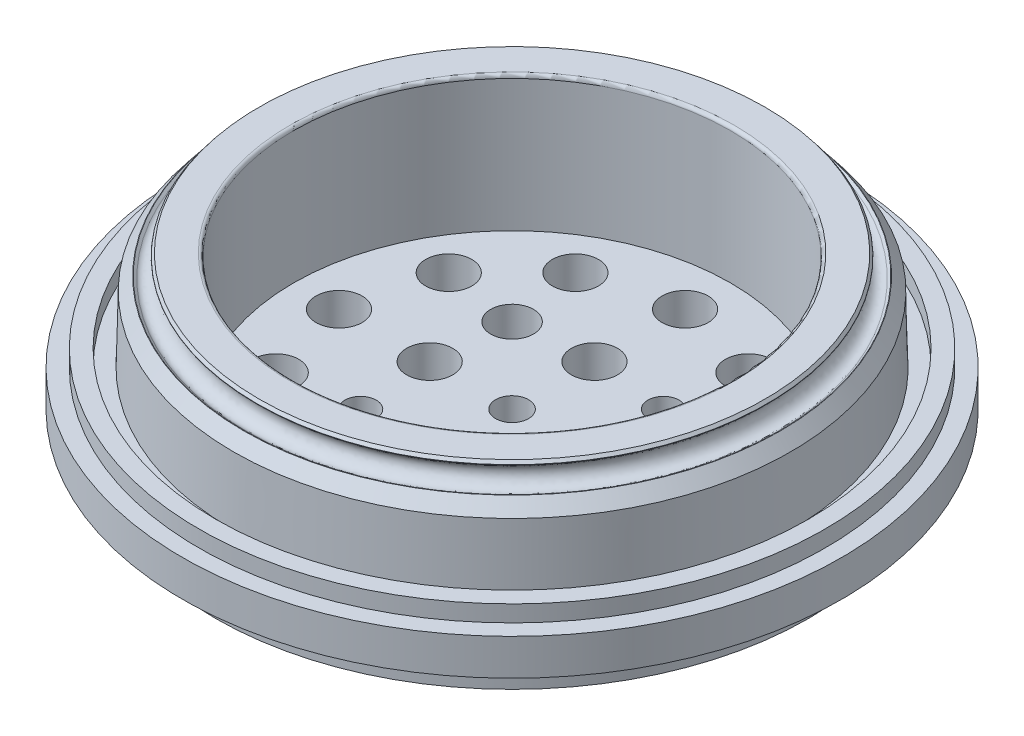
ISO-10303-21;
HEADER;
FILE_DESCRIPTION(('STEP AP214'),'2;1');
FILE_NAME('part.step','',(''),(''),'','','');
FILE_SCHEMA(('AUTOMOTIVE_DESIGN { 1 0 10303 214 1 1 1 1 }'));
ENDSEC;
DATA;
#1=APPLICATION_CONTEXT('core data for automotive mechanical design processes');
#2=APPLICATION_PROTOCOL_DEFINITION('international standard','automotive_design',2000,#1);
#3=PRODUCT_CONTEXT('',#1,'mechanical');
#4=PRODUCT('Part','Part','',(#3));
#5=PRODUCT_RELATED_PRODUCT_CATEGORY('part','',(#4));
#6=PRODUCT_DEFINITION_FORMATION('','',#4);
#7=PRODUCT_DEFINITION_CONTEXT('part definition',#1,'design');
#8=PRODUCT_DEFINITION('design','',#6,#7);
#9=PRODUCT_DEFINITION_SHAPE('','',#8);
#10=(LENGTH_UNIT() NAMED_UNIT(*) SI_UNIT(.MILLI.,.METRE.));
#11=(NAMED_UNIT(*) PLANE_ANGLE_UNIT() SI_UNIT($,.RADIAN.));
#12=(NAMED_UNIT(*) SI_UNIT($,.STERADIAN.) SOLID_ANGLE_UNIT());
#13=UNCERTAINTY_MEASURE_WITH_UNIT(LENGTH_MEASURE(1.E-05),#10,'distance_accuracy_value','');
#14=(GEOMETRIC_REPRESENTATION_CONTEXT(3) GLOBAL_UNCERTAINTY_ASSIGNED_CONTEXT((#13)) GLOBAL_UNIT_ASSIGNED_CONTEXT((#10,
#11,#12)) REPRESENTATION_CONTEXT('',''));
#15=CARTESIAN_POINT('',(0.,0.,0.));
#16=DIRECTION('',(0.,0.,1.));
#17=DIRECTION('',(1.,0.,0.));
#18=AXIS2_PLACEMENT_3D('',#15,#16,#17);
#19=CARTESIAN_POINT('',(78.5764516158101,36.6517230972502,0.));
#20=DIRECTION('',(0.,0.,1.));
#21=DIRECTION('',(-0.612631200186802,0.790368909154249,0.));
#22=AXIS2_PLACEMENT_3D('',#19,#20,#21);
#23=ELLIPSE('',#22,3.17500000000001,2.67499999999999);
#24=CARTESIAN_POINT('',(0.,0.,0.));
#25=DIRECTION('',(0.,-1.,0.));
#26=AXIS1_PLACEMENT('',#24,#25);
#27=SURFACE_OF_REVOLUTION('',#23,#26);
#28=CARTESIAN_POINT('',(0.,34.1423018106855,0.));
#29=DIRECTION('',(0.,-1.,0.));
#30=DIRECTION('',(0.,0.,-1.));
#31=AXIS2_PLACEMENT_3D('',#28,#29,#30);
#32=CIRCLE('',#31,80.5215556764032);
#33=CARTESIAN_POINT('',(0.,34.1423018106855,-80.5215556764032));
#34=VERTEX_POINT('',#33);
#35=EDGE_CURVE('E91',#34,#34,#32,.T.);
#36=ORIENTED_EDGE('',*,*,#35,.F.);
#37=EDGE_LOOP('',(#36));
#38=FACE_BOUND('',#37,.T.);
#39=CARTESIAN_POINT('',(0.,39.1611443838149,0.));
#40=DIRECTION('',(0.,-1.,0.));
#41=DIRECTION('',(0.,0.,-1.));
#42=AXIS2_PLACEMENT_3D('',#39,#40,#41);
#43=CIRCLE('',#42,76.631347555217);
#44=CARTESIAN_POINT('',(0.,39.1611443838149,-76.631347555217));
#45=VERTEX_POINT('',#44);
#46=EDGE_CURVE('E78',#45,#45,#43,.T.);
#47=ORIENTED_EDGE('',*,*,#46,.T.);
#48=EDGE_LOOP('',(#47));
#49=FACE_BOUND('',#48,.T.);
#50=ADVANCED_FACE('F43',(#38,#49),#27,.T.);
#51=CARTESIAN_POINT('',(0.,39.1611443838149,0.));
#52=DIRECTION('',(0.,1.,0.));
#53=DIRECTION('',(0.,0.,1.));
#54=AXIS2_PLACEMENT_3D('',#51,#52,#53);
#55=CONICAL_SURFACE('',#54,76.631347555217,0.911410935391439);
#56=CARTESIAN_POINT('',(0.,39.7529461231954,0.));
#57=DIRECTION('',(0.,1.,0.));
#58=DIRECTION('',(0.,0.,1.));
#59=AXIS2_PLACEMENT_3D('',#56,#57,#58);
#60=CIRCLE('',#59,77.39484392146);
#61=CARTESIAN_POINT('',(0.,39.7529461231954,77.39484392146));
#62=VERTEX_POINT('',#61);
#63=EDGE_CURVE('E63',#62,#62,#60,.F.);
#64=ORIENTED_EDGE('',*,*,#63,.T.);
#65=EDGE_LOOP('',(#64));
#66=FACE_BOUND('',#65,.T.);
#67=ORIENTED_EDGE('',*,*,#46,.F.);
#68=EDGE_LOOP('',(#67));
#69=FACE_BOUND('',#68,.T.);
#70=ADVANCED_FACE('F134',(#66,#69),#55,.T.);
#71=CARTESIAN_POINT('',(0.,40.74810371,0.));
#72=DIRECTION('',(0.,-1.,0.));
#73=DIRECTION('',(0.,0.,-1.));
#74=AXIS2_PLACEMENT_3D('',#71,#72,#73);
#75=CONICAL_SURFACE('',#74,76.75,0.65938539140346);
#76=CARTESIAN_POINT('',(0.,39.8932461341295,0.));
#77=DIRECTION('',(0.,-1.,0.));
#78=DIRECTION('',(0.,0.,-1.));
#79=AXIS2_PLACEMENT_3D('',#76,#77,#78);
#80=CIRCLE('',#79,77.4126176923568);
#81=CARTESIAN_POINT('',(0.,39.8932461341295,-77.4126176923568));
#82=VERTEX_POINT('',#81);
#83=EDGE_CURVE('E57',#82,#82,#80,.F.);
#84=ORIENTED_EDGE('',*,*,#83,.T.);
#85=EDGE_LOOP('',(#84));
#86=FACE_BOUND('',#85,.T.);
#87=CARTESIAN_POINT('',(0.,40.74810371,0.));
#88=DIRECTION('',(0.,-1.,0.));
#89=DIRECTION('',(0.,0.,-1.));
#90=AXIS2_PLACEMENT_3D('',#87,#88,#89);
#91=CIRCLE('',#90,76.75);
#92=CARTESIAN_POINT('',(0.,40.74810371,-76.75));
#93=VERTEX_POINT('',#92);
#94=EDGE_CURVE('E82',#93,#93,#91,.T.);
#95=ORIENTED_EDGE('',*,*,#94,.T.);
#96=EDGE_LOOP('',(#95));
#97=FACE_BOUND('',#96,.T.);
#98=ADVANCED_FACE('F161',(#86,#97),#75,.T.);
#99=CARTESIAN_POINT('',(0.,40.74810371,0.));
#100=DIRECTION('',(0.,-1.,0.));
#101=DIRECTION('',(0.,0.,-1.));
#102=AXIS2_PLACEMENT_3D('',#99,#100,#101);
#103=PLANE('',#102);
#104=CARTESIAN_POINT('',(0.,40.74810371,0.));
#105=DIRECTION('',(0.,-1.,0.));
#106=DIRECTION('',(0.,0.,-1.));
#107=AXIS2_PLACEMENT_3D('',#104,#105,#106);
#108=CIRCLE('',#107,67.3264516158101);
#109=CARTESIAN_POINT('',(0.,40.74810371,-67.3264516158101));
#110=VERTEX_POINT('',#109);
#111=EDGE_CURVE('E74',#110,#110,#108,.T.);
#112=ORIENTED_EDGE('',*,*,#111,.T.);
#113=EDGE_LOOP('',(#112));
#114=FACE_BOUND('',#113,.T.);
#115=ORIENTED_EDGE('',*,*,#94,.F.);
#116=EDGE_LOOP('',(#115));
#117=FACE_BOUND('',#116,.T.);
#118=ADVANCED_FACE('F167',(#114,#117),#103,.F.);
#119=CARTESIAN_POINT('',(0.,0.,0.));
#120=DIRECTION('',(0.,-1.,0.));
#121=DIRECTION('',(0.,0.,-1.));
#122=AXIS2_PLACEMENT_3D('',#119,#120,#121);
#123=CYLINDRICAL_SURFACE('',#122,66.3264516158101);
#124=CARTESIAN_POINT('',(0.,39.74810371,0.));
#125=DIRECTION('',(0.,-1.,0.));
#126=DIRECTION('',(0.,0.,-1.));
#127=AXIS2_PLACEMENT_3D('',#124,#125,#126);
#128=CIRCLE('',#127,66.3264516158101);
#129=CARTESIAN_POINT('',(0.,39.74810371,-66.3264516158101));
#130=VERTEX_POINT('',#129);
#131=EDGE_CURVE('E70',#130,#130,#128,.F.);
#132=ORIENTED_EDGE('',*,*,#131,.T.);
#133=EDGE_LOOP('',(#132));
#134=FACE_BOUND('',#133,.T.);
#135=CARTESIAN_POINT('',(0.,-0.262378674365377,0.));
#136=DIRECTION('',(0.,-1.,0.));
#137=DIRECTION('',(0.,0.,-1.));
#138=AXIS2_PLACEMENT_3D('',#135,#136,#137);
#139=CIRCLE('',#138,66.3264516158101);
#140=CARTESIAN_POINT('',(0.,-0.262378674365377,-66.3264516158101));
#141=VERTEX_POINT('',#140);
#142=EDGE_CURVE('E87',#141,#141,#139,.T.);
#143=ORIENTED_EDGE('',*,*,#142,.T.);
#144=EDGE_LOOP('',(#143));
#145=FACE_BOUND('',#144,.T.);
#146=ADVANCED_FACE('F173',(#134,#145),#123,.F.);
#147=CARTESIAN_POINT('',(0.,-0.262378674365377,0.));
#148=DIRECTION('',(0.,-1.,0.));
#149=DIRECTION('',(0.,0.,-1.));
#150=AXIS2_PLACEMENT_3D('',#147,#148,#149);
#151=PLANE('',#150);
#152=CARTESIAN_POINT('',(0.,-0.262378674365377,0.));
#153=DIRECTION('',(0.,-1.,0.));
#154=DIRECTION('',(0.,0.,-1.));
#155=AXIS2_PLACEMENT_3D('',#152,#153,#154);
#156=CIRCLE('',#155,90.);
#157=CARTESIAN_POINT('',(0.,-0.262378674365377,-90.));
#158=VERTEX_POINT('',#157);
#159=EDGE_CURVE('E69',#158,#158,#156,.T.);
#160=ORIENTED_EDGE('',*,*,#159,.F.);
#161=EDGE_LOOP('',(#160));
#162=FACE_BOUND('',#161,.T.);
#163=CARTESIAN_POINT('',(0.,-0.262378674365377,0.));
#164=DIRECTION('',(0.,-1.,0.));
#165=DIRECTION('',(0.,0.,-1.));
#166=AXIS2_PLACEMENT_3D('',#163,#164,#165);
#167=CIRCLE('',#166,100.);
#168=CARTESIAN_POINT('',(0.,-0.262378674365377,-100.));
#169=VERTEX_POINT('',#168);
#170=EDGE_CURVE('E86',#169,#169,#167,.T.);
#171=ORIENTED_EDGE('',*,*,#170,.T.);
#172=EDGE_LOOP('',(#171));
#173=FACE_BOUND('',#172,.T.);
#174=ADVANCED_FACE('F180',(#162,#173),#151,.T.);
#175=CARTESIAN_POINT('',(0.,0.,0.));
#176=DIRECTION('',(0.,-1.,0.));
#177=DIRECTION('',(0.,0.,-1.));
#178=AXIS2_PLACEMENT_3D('',#175,#176,#177);
#179=CYLINDRICAL_SURFACE('',#178,100.);
#180=ORIENTED_EDGE('',*,*,#170,.F.);
#181=EDGE_LOOP('',(#180));
#182=FACE_BOUND('',#181,.T.);
#183=CARTESIAN_POINT('',(0.,10.7376213256346,0.));
#184=DIRECTION('',(0.,-1.,0.));
#185=DIRECTION('',(0.,0.,-1.));
#186=AXIS2_PLACEMENT_3D('',#183,#184,#185);
#187=CIRCLE('',#186,100.);
#188=CARTESIAN_POINT('',(0.,10.7376213256346,-100.));
#189=VERTEX_POINT('',#188);
#190=EDGE_CURVE('E96',#189,#189,#187,.T.);
#191=ORIENTED_EDGE('',*,*,#190,.T.);
#192=EDGE_LOOP('',(#191));
#193=FACE_BOUND('',#192,.T.);
#194=ADVANCED_FACE('F184',(#182,#193),#179,.T.);
#195=CARTESIAN_POINT('',(0.,10.7376213256346,0.));
#196=DIRECTION('',(0.,-1.,0.));
#197=DIRECTION('',(0.,0.,-1.));
#198=AXIS2_PLACEMENT_3D('',#195,#196,#197);
#199=PLANE('',#198);
#200=ORIENTED_EDGE('',*,*,#190,.F.);
#201=EDGE_LOOP('',(#200));
#202=FACE_BOUND('',#201,.T.);
#203=CARTESIAN_POINT('',(0.,10.7376213256346,0.));
#204=DIRECTION('',(0.,-1.,0.));
#205=DIRECTION('',(0.,0.,-1.));
#206=AXIS2_PLACEMENT_3D('',#203,#204,#205);
#207=CIRCLE('',#206,95.);
#208=CARTESIAN_POINT('',(0.,10.7376213256346,-95.));
#209=VERTEX_POINT('',#208);
#210=EDGE_CURVE('E100',#209,#209,#207,.T.);
#211=ORIENTED_EDGE('',*,*,#210,.T.);
#212=EDGE_LOOP('',(#211));
#213=FACE_BOUND('',#212,.T.);
#214=ADVANCED_FACE('F188',(#202,#213),#199,.F.);
#215=CARTESIAN_POINT('',(0.,0.,0.));
#216=DIRECTION('',(0.,-1.,0.));
#217=DIRECTION('',(0.,0.,-1.));
#218=AXIS2_PLACEMENT_3D('',#215,#216,#217);
#219=CYLINDRICAL_SURFACE('',#218,95.);
#220=ORIENTED_EDGE('',*,*,#210,.F.);
#221=EDGE_LOOP('',(#220));
#222=FACE_BOUND('',#221,.T.);
#223=CARTESIAN_POINT('',(0.,15.7376213256346,0.));
#224=DIRECTION('',(0.,-1.,0.));
#225=DIRECTION('',(0.,0.,-1.));
#226=AXIS2_PLACEMENT_3D('',#223,#224,#225);
#227=CIRCLE('',#226,95.);
#228=CARTESIAN_POINT('',(0.,15.7376213256346,-95.));
#229=VERTEX_POINT('',#228);
#230=EDGE_CURVE('E104',#229,#229,#227,.T.);
#231=ORIENTED_EDGE('',*,*,#230,.T.);
#232=EDGE_LOOP('',(#231));
#233=FACE_BOUND('',#232,.T.);
#234=ADVANCED_FACE('F192',(#222,#233),#219,.T.);
#235=CARTESIAN_POINT('',(0.,15.7376213256346,0.));
#236=DIRECTION('',(0.,-1.,0.));
#237=DIRECTION('',(0.,0.,-1.));
#238=AXIS2_PLACEMENT_3D('',#235,#236,#237);
#239=PLANE('',#238);
#240=ORIENTED_EDGE('',*,*,#230,.F.);
#241=EDGE_LOOP('',(#240));
#242=FACE_BOUND('',#241,.T.);
#243=CARTESIAN_POINT('',(0.,15.7376213256346,0.));
#244=DIRECTION('',(0.,-1.,0.));
#245=DIRECTION('',(0.,0.,-1.));
#246=AXIS2_PLACEMENT_3D('',#243,#244,#245);
#247=CIRCLE('',#246,89.9);
#248=CARTESIAN_POINT('',(0.,15.7376213256346,-89.9));
#249=VERTEX_POINT('',#248);
#250=EDGE_CURVE('E108',#249,#249,#247,.T.);
#251=ORIENTED_EDGE('',*,*,#250,.T.);
#252=EDGE_LOOP('',(#251));
#253=FACE_BOUND('',#252,.T.);
#254=ADVANCED_FACE('F196',(#242,#253),#239,.F.);
#255=CARTESIAN_POINT('',(0.,0.,0.));
#256=DIRECTION('',(0.,-1.,0.));
#257=DIRECTION('',(0.,0.,-1.));
#258=AXIS2_PLACEMENT_3D('',#255,#256,#257);
#259=CYLINDRICAL_SURFACE('',#258,89.9);
#260=ORIENTED_EDGE('',*,*,#250,.F.);
#261=EDGE_LOOP('',(#260));
#262=FACE_BOUND('',#261,.T.);
#263=CARTESIAN_POINT('',(0.,10.7376213256346,0.));
#264=DIRECTION('',(0.,-1.,0.));
#265=DIRECTION('',(0.,0.,-1.));
#266=AXIS2_PLACEMENT_3D('',#263,#264,#265);
#267=CIRCLE('',#266,89.9);
#268=CARTESIAN_POINT('',(0.,10.7376213256346,-89.9));
#269=VERTEX_POINT('',#268);
#270=EDGE_CURVE('E112',#269,#269,#267,.T.);
#271=ORIENTED_EDGE('',*,*,#270,.T.);
#272=EDGE_LOOP('',(#271));
#273=FACE_BOUND('',#272,.T.);
#274=ADVANCED_FACE('F200',(#262,#273),#259,.F.);
#275=CARTESIAN_POINT('',(0.,10.7376213256346,0.));
#276=DIRECTION('',(0.,-1.,0.));
#277=DIRECTION('',(0.,0.,-1.));
#278=AXIS2_PLACEMENT_3D('',#275,#276,#277);
#279=PLANE('',#278);
#280=ORIENTED_EDGE('',*,*,#270,.F.);
#281=EDGE_LOOP('',(#280));
#282=FACE_BOUND('',#281,.T.);
#283=CARTESIAN_POINT('',(0.,10.7376213256346,0.));
#284=DIRECTION('',(0.,-1.,0.));
#285=DIRECTION('',(0.,0.,-1.));
#286=AXIS2_PLACEMENT_3D('',#283,#284,#285);
#287=CIRCLE('',#286,84.99);
#288=CARTESIAN_POINT('',(0.,10.7376213256346,-84.99));
#289=VERTEX_POINT('',#288);
#290=EDGE_CURVE('E116',#289,#289,#287,.T.);
#291=ORIENTED_EDGE('',*,*,#290,.T.);
#292=EDGE_LOOP('',(#291));
#293=FACE_BOUND('',#292,.T.);
#294=ADVANCED_FACE('F204',(#282,#293),#279,.F.);
#295=CARTESIAN_POINT('',(0.,30.7496592232066,0.));
#296=DIRECTION('',(0.,-1.,0.));
#297=DIRECTION('',(0.,0.,-1.));
#298=AXIS2_PLACEMENT_3D('',#295,#296,#297);
#299=CONICAL_SURFACE('',#298,84.5,0.0244803710045761);
#300=ORIENTED_EDGE('',*,*,#290,.F.);
#301=EDGE_LOOP('',(#300));
#302=FACE_BOUND('',#301,.T.);
#303=CARTESIAN_POINT('',(0.,30.7496592232066,0.));
#304=DIRECTION('',(0.,-1.,0.));
#305=DIRECTION('',(0.,0.,-1.));
#306=AXIS2_PLACEMENT_3D('',#303,#304,#305);
#307=CIRCLE('',#306,84.5);
#308=CARTESIAN_POINT('',(0.,30.7496592232066,-84.5));
#309=VERTEX_POINT('',#308);
#310=EDGE_CURVE('E120',#309,#309,#307,.T.);
#311=ORIENTED_EDGE('',*,*,#310,.T.);
#312=EDGE_LOOP('',(#311));
#313=FACE_BOUND('',#312,.T.);
#314=ADVANCED_FACE('F208',(#302,#313),#299,.T.);
#315=CARTESIAN_POINT('',(0.,34.7953666700846,0.));
#316=DIRECTION('',(0.,-1.,0.));
#317=DIRECTION('',(0.,0.,-1.));
#318=AXIS2_PLACEMENT_3D('',#315,#316,#317);
#319=CONICAL_SURFACE('',#318,81.3640889335617,0.659385391403459);
#320=CARTESIAN_POINT('',(0.,34.7163297791692,0.));
#321=DIRECTION('',(0.,1.,0.));
#322=DIRECTION('',(0.,0.,1.));
#323=AXIS2_PLACEMENT_3D('',#320,#321,#322);
#324=CIRCLE('',#323,81.4253520535804);
#325=CARTESIAN_POINT('',(0.,34.7163297791692,81.4253520535804));
#326=VERTEX_POINT('',#325);
#327=EDGE_CURVE('E51',#326,#326,#324,.F.);
#328=ORIENTED_EDGE('',*,*,#327,.T.);
#329=EDGE_LOOP('',(#328));
#330=FACE_BOUND('',#329,.T.);
#331=ORIENTED_EDGE('',*,*,#310,.F.);
#332=EDGE_LOOP('',(#331));
#333=FACE_BOUND('',#332,.T.);
#334=ADVANCED_FACE('F212',(#330,#333),#319,.T.);
#335=CARTESIAN_POINT('',(0.,34.1423018106855,0.));
#336=DIRECTION('',(0.,1.,0.));
#337=DIRECTION('',(0.,0.,1.));
#338=AXIS2_PLACEMENT_3D('',#335,#336,#337);
#339=CONICAL_SURFACE('',#338,80.5215556764032,0.911410935391436);
#340=CARTESIAN_POINT('',(0.,34.734103550066,0.));
#341=DIRECTION('',(0.,-1.,0.));
#342=DIRECTION('',(0.,0.,-1.));
#343=AXIS2_PLACEMENT_3D('',#340,#341,#342);
#344=CIRCLE('',#343,81.2850520426462);
#345=CARTESIAN_POINT('',(0.,34.734103550066,-81.2850520426462));
#346=VERTEX_POINT('',#345);
#347=EDGE_CURVE('E10',#346,#346,#344,.F.);
#348=ORIENTED_EDGE('',*,*,#347,.T.);
#349=EDGE_LOOP('',(#348));
#350=FACE_BOUND('',#349,.T.);
#351=ORIENTED_EDGE('',*,*,#35,.T.);
#352=EDGE_LOOP('',(#351));
#353=FACE_BOUND('',#352,.T.);
#354=ADVANCED_FACE('F140',(#350,#353),#339,.F.);
#355=CARTESIAN_POINT('',(0.,39.74810371,0.));
#356=DIRECTION('',(0.,-1.,0.));
#357=DIRECTION('',(0.,0.,-1.));
#358=AXIS2_PLACEMENT_3D('',#355,#356,#357);
#359=TOROIDAL_SURFACE('',#358,67.3264516158101,1.);
#360=ORIENTED_EDGE('',*,*,#131,.F.);
#361=EDGE_LOOP('',(#360));
#362=FACE_BOUND('',#361,.T.);
#363=ORIENTED_EDGE('',*,*,#111,.F.);
#364=EDGE_LOOP('',(#363));
#365=FACE_BOUND('',#364,.T.);
#366=ADVANCED_FACE('F137',(#362,#365),#359,.T.);
#367=CARTESIAN_POINT('',(0.,-10.2623786743654,0.));
#368=DIRECTION('',(0.,-1.,0.));
#369=DIRECTION('',(0.,0.,-1.));
#370=AXIS2_PLACEMENT_3D('',#367,#368,#369);
#371=PLANE('',#370);
#372=CARTESIAN_POINT('',(-26.25,-10.2623786743654,-45.466333698683));
#373=DIRECTION('',(0.,-1.,0.));
#374=DIRECTION('',(0.,0.,-1.));
#375=AXIS2_PLACEMENT_3D('',#372,#373,#374);
#376=CIRCLE('',#375,7.00000000000042);
#377=CARTESIAN_POINT('',(-26.25,-10.2623786743654,-52.4663336986834));
#378=VERTEX_POINT('',#377);
#379=EDGE_CURVE('E383',#378,#378,#376,.T.);
#380=ORIENTED_EDGE('',*,*,#379,.F.);
#381=EDGE_LOOP('',(#380));
#382=FACE_BOUND('',#381,.T.);
#383=CARTESIAN_POINT('',(-45.466333698683,-10.2623786743654,-26.25));
#384=DIRECTION('',(0.,-1.,0.));
#385=DIRECTION('',(0.,0.,-1.));
#386=AXIS2_PLACEMENT_3D('',#383,#384,#385);
#387=CIRCLE('',#386,7.00000000000048);
#388=CARTESIAN_POINT('',(-45.466333698683,-10.2623786743654,-33.2500000000005));
#389=VERTEX_POINT('',#388);
#390=EDGE_CURVE('E391',#389,#389,#387,.T.);
#391=ORIENTED_EDGE('',*,*,#390,.F.);
#392=EDGE_LOOP('',(#391));
#393=FACE_BOUND('',#392,.T.);
#394=CARTESIAN_POINT('',(-52.5,-10.2623786743654,0.));
#395=DIRECTION('',(0.,-1.,0.));
#396=DIRECTION('',(0.,0.,-1.));
#397=AXIS2_PLACEMENT_3D('',#394,#395,#396);
#398=CIRCLE('',#397,7.00000000000052);
#399=CARTESIAN_POINT('',(-52.5,-10.2623786743654,-7.00000000000052));
#400=VERTEX_POINT('',#399);
#401=EDGE_CURVE('E399',#400,#400,#398,.T.);
#402=ORIENTED_EDGE('',*,*,#401,.F.);
#403=EDGE_LOOP('',(#402));
#404=FACE_BOUND('',#403,.T.);
#405=CARTESIAN_POINT('',(-45.4663336986827,-10.2623786743654,26.2500000000005));
#406=DIRECTION('',(0.,-1.,0.));
#407=DIRECTION('',(0.,0.,-1.));
#408=AXIS2_PLACEMENT_3D('',#405,#406,#407);
#409=CIRCLE('',#408,7.);
#410=CARTESIAN_POINT('',(-45.4663336986827,-10.2623786743654,19.2500000000005));
#411=VERTEX_POINT('',#410);
#412=EDGE_CURVE('E366',#411,#411,#409,.T.);
#413=ORIENTED_EDGE('',*,*,#412,.F.);
#414=EDGE_LOOP('',(#413));
#415=FACE_BOUND('',#414,.T.);
#416=CARTESIAN_POINT('',(-25.0000000000012,-10.2623786743654,2.02962646689286E-13));
#417=DIRECTION('',(0.,-1.,0.));
#418=DIRECTION('',(0.,0.,-1.));
#419=AXIS2_PLACEMENT_3D('',#416,#417,#418);
#420=CIRCLE('',#419,6.9999999999997);
#421=CARTESIAN_POINT('',(-25.0000000000012,-10.2623786743654,-6.9999999999995));
#422=VERTEX_POINT('',#421);
#423=EDGE_CURVE('E338',#422,#422,#420,.T.);
#424=ORIENTED_EDGE('',*,*,#423,.F.);
#425=EDGE_LOOP('',(#424));
#426=FACE_BOUND('',#425,.T.);
#427=CARTESIAN_POINT('',(-2.4151429085138E-12,-10.2623786743654,-24.9999999999996));
#428=DIRECTION('',(0.,-1.,0.));
#429=DIRECTION('',(0.,0.,-1.));
#430=AXIS2_PLACEMENT_3D('',#427,#428,#429);
#431=CIRCLE('',#430,6.99999999999798);
#432=CARTESIAN_POINT('',(-2.4151429085138E-12,-10.2623786743654,-31.9999999999976));
#433=VERTEX_POINT('',#432);
#434=EDGE_CURVE('E351',#433,#433,#431,.T.);
#435=ORIENTED_EDGE('',*,*,#434,.F.);
#436=EDGE_LOOP('',(#435));
#437=FACE_BOUND('',#436,.T.);
#438=CARTESIAN_POINT('',(24.9999999999988,-10.2623786743654,2.02962646689286E-13));
#439=DIRECTION('',(0.,-1.,0.));
#440=DIRECTION('',(0.,0.,-1.));
#441=AXIS2_PLACEMENT_3D('',#438,#439,#440);
#442=CIRCLE('',#441,7.00000000000063);
#443=CARTESIAN_POINT('',(24.9999999999988,-10.2623786743654,-7.00000000000043));
#444=VERTEX_POINT('',#443);
#445=EDGE_CURVE('E350',#444,#444,#442,.T.);
#446=ORIENTED_EDGE('',*,*,#445,.F.);
#447=EDGE_LOOP('',(#446));
#448=FACE_BOUND('',#447,.T.);
#449=CARTESIAN_POINT('',(-26.2499999999994,-10.2623786743654,45.4663336986834));
#450=DIRECTION('',(0.,-1.,0.));
#451=DIRECTION('',(0.,0.,-1.));
#452=AXIS2_PLACEMENT_3D('',#449,#450,#451);
#453=CIRCLE('',#452,7.);
#454=CARTESIAN_POINT('',(-26.2499999999994,-10.2623786743654,38.4663336986834));
#455=VERTEX_POINT('',#454);
#456=EDGE_CURVE('E367',#455,#455,#453,.T.);
#457=ORIENTED_EDGE('',*,*,#456,.F.);
#458=EDGE_LOOP('',(#457));
#459=FACE_BOUND('',#458,.T.);
#460=CARTESIAN_POINT('',(0.,-10.2623786743654,25.));
#461=DIRECTION('',(0.,-1.,0.));
#462=DIRECTION('',(0.,0.,-1.));
#463=AXIS2_PLACEMENT_3D('',#460,#461,#462);
#464=CIRCLE('',#463,7.);
#465=CARTESIAN_POINT('',(0.,-10.2623786743654,18.));
#466=VERTEX_POINT('',#465);
#467=EDGE_CURVE('E447',#466,#466,#464,.T.);
#468=ORIENTED_EDGE('',*,*,#467,.F.);
#469=EDGE_LOOP('',(#468));
#470=FACE_BOUND('',#469,.T.);
#471=CARTESIAN_POINT('',(0.,-10.2623786743654,0.));
#472=DIRECTION('',(0.,-1.,0.));
#473=DIRECTION('',(0.,0.,-1.));
#474=AXIS2_PLACEMENT_3D('',#471,#472,#473);
#475=CIRCLE('',#474,5.);
#476=CARTESIAN_POINT('',(0.,-10.2623786743654,-5.));
#477=VERTEX_POINT('',#476);
#478=EDGE_CURVE('E455',#477,#477,#475,.T.);
#479=ORIENTED_EDGE('',*,*,#478,.F.);
#480=EDGE_LOOP('',(#479));
#481=FACE_BOUND('',#480,.T.);
#482=CARTESIAN_POINT('',(26.25,-10.2623786743654,45.466333698683));
#483=DIRECTION('',(0.,-1.,0.));
#484=DIRECTION('',(0.,0.,-1.));
#485=AXIS2_PLACEMENT_3D('',#482,#483,#484);
#486=CIRCLE('',#485,7.);
#487=CARTESIAN_POINT('',(26.25,-10.2623786743654,38.466333698683));
#488=VERTEX_POINT('',#487);
#489=EDGE_CURVE('E463',#488,#488,#486,.T.);
#490=ORIENTED_EDGE('',*,*,#489,.F.);
#491=EDGE_LOOP('',(#490));
#492=FACE_BOUND('',#491,.T.);
#493=CARTESIAN_POINT('',(45.4663336986831,-10.2623786743654,26.2499999999999));
#494=DIRECTION('',(0.,-1.,0.));
#495=DIRECTION('',(0.,0.,-1.));
#496=AXIS2_PLACEMENT_3D('',#493,#494,#495);
#497=CIRCLE('',#496,7.);
#498=CARTESIAN_POINT('',(45.4663336986831,-10.2623786743654,19.2499999999999));
#499=VERTEX_POINT('',#498);
#500=EDGE_CURVE('E414',#499,#499,#497,.T.);
#501=ORIENTED_EDGE('',*,*,#500,.F.);
#502=EDGE_LOOP('',(#501));
#503=FACE_BOUND('',#502,.T.);
#504=CARTESIAN_POINT('',(52.5,-10.2623786743654,0.));
#505=DIRECTION('',(0.,-1.,0.));
#506=DIRECTION('',(0.,0.,-1.));
#507=AXIS2_PLACEMENT_3D('',#504,#505,#506);
#508=CIRCLE('',#507,7.00000000000018);
#509=CARTESIAN_POINT('',(52.5,-10.2623786743654,-7.00000000000018));
#510=VERTEX_POINT('',#509);
#511=EDGE_CURVE('E415',#510,#510,#508,.T.);
#512=ORIENTED_EDGE('',*,*,#511,.F.);
#513=EDGE_LOOP('',(#512));
#514=FACE_BOUND('',#513,.T.);
#515=CARTESIAN_POINT('',(45.466333698683,-10.2623786743654,-26.25));
#516=DIRECTION('',(0.,-1.,0.));
#517=DIRECTION('',(0.,0.,-1.));
#518=AXIS2_PLACEMENT_3D('',#515,#516,#517);
#519=CIRCLE('',#518,7.00000000000024);
#520=CARTESIAN_POINT('',(45.466333698683,-10.2623786743654,-33.2500000000002));
#521=VERTEX_POINT('',#520);
#522=EDGE_CURVE('E423',#521,#521,#519,.T.);
#523=ORIENTED_EDGE('',*,*,#522,.F.);
#524=EDGE_LOOP('',(#523));
#525=FACE_BOUND('',#524,.T.);
#526=CARTESIAN_POINT('',(26.25,-10.2623786743654,-45.466333698683));
#527=DIRECTION('',(0.,-1.,0.));
#528=DIRECTION('',(0.,0.,-1.));
#529=AXIS2_PLACEMENT_3D('',#526,#527,#528);
#530=CIRCLE('',#529,7.0000000000003);
#531=CARTESIAN_POINT('',(26.25,-10.2623786743654,-52.4663336986833));
#532=VERTEX_POINT('',#531);
#533=EDGE_CURVE('E431',#532,#532,#530,.T.);
#534=ORIENTED_EDGE('',*,*,#533,.F.);
#535=EDGE_LOOP('',(#534));
#536=FACE_BOUND('',#535,.T.);
#537=CARTESIAN_POINT('',(0.,-10.2623786743654,-52.5));
#538=DIRECTION('',(0.,-1.,0.));
#539=DIRECTION('',(0.,0.,-1.));
#540=AXIS2_PLACEMENT_3D('',#537,#538,#539);
#541=CIRCLE('',#540,7.00000000000035);
#542=CARTESIAN_POINT('',(0.,-10.2623786743654,-59.5000000000003));
#543=VERTEX_POINT('',#542);
#544=EDGE_CURVE('E382',#543,#543,#541,.T.);
#545=ORIENTED_EDGE('',*,*,#544,.F.);
#546=EDGE_LOOP('',(#545));
#547=FACE_BOUND('',#546,.T.);
#548=CARTESIAN_POINT('',(22.9809703885626,-10.2623786743654,-22.980970388563));
#549=DIRECTION('',(0.,-1.,0.));
#550=DIRECTION('',(0.,0.,-1.));
#551=AXIS2_PLACEMENT_3D('',#548,#549,#550);
#552=CIRCLE('',#551,4.76249999999999);
#553=CARTESIAN_POINT('',(22.9809703885626,-10.2623786743654,-27.743470388563));
#554=VERTEX_POINT('',#553);
#555=EDGE_CURVE('E330',#554,#554,#552,.T.);
#556=ORIENTED_EDGE('',*,*,#555,.F.);
#557=EDGE_LOOP('',(#556));
#558=FACE_BOUND('',#557,.T.);
#559=CARTESIAN_POINT('',(-22.9809703885626,-10.2623786743654,22.980970388563));
#560=DIRECTION('',(0.,-1.,0.));
#561=DIRECTION('',(0.,0.,-1.));
#562=AXIS2_PLACEMENT_3D('',#559,#560,#561);
#563=CIRCLE('',#562,4.7625);
#564=CARTESIAN_POINT('',(-22.9809703885626,-10.2623786743654,18.218470388563));
#565=VERTEX_POINT('',#564);
#566=EDGE_CURVE('E310',#565,#565,#563,.T.);
#567=ORIENTED_EDGE('',*,*,#566,.F.);
#568=EDGE_LOOP('',(#567));
#569=FACE_BOUND('',#568,.T.);
#570=CARTESIAN_POINT('',(-22.9809703885629,-10.2623786743654,-22.9809703885627));
#571=DIRECTION('',(0.,-1.,0.));
#572=DIRECTION('',(0.,0.,-1.));
#573=AXIS2_PLACEMENT_3D('',#570,#571,#572);
#574=CIRCLE('',#573,6.5);
#575=CARTESIAN_POINT('',(-22.9809703885629,-10.2623786743654,-29.4809703885627));
#576=VERTEX_POINT('',#575);
#577=EDGE_CURVE('E316',#576,#576,#574,.T.);
#578=ORIENTED_EDGE('',*,*,#577,.F.);
#579=EDGE_LOOP('',(#578));
#580=FACE_BOUND('',#579,.T.);
#581=CARTESIAN_POINT('',(22.9809703885629,-10.2623786743654,22.9809703885627));
#582=DIRECTION('',(0.,-1.,0.));
#583=DIRECTION('',(0.,0.,-1.));
#584=AXIS2_PLACEMENT_3D('',#581,#582,#583);
#585=CIRCLE('',#584,6.5);
#586=CARTESIAN_POINT('',(22.9809703885629,-10.2623786743654,16.4809703885627));
#587=VERTEX_POINT('',#586);
#588=EDGE_CURVE('E339',#587,#587,#585,.T.);
#589=ORIENTED_EDGE('',*,*,#588,.F.);
#590=EDGE_LOOP('',(#589));
#591=FACE_BOUND('',#590,.T.);
#592=CARTESIAN_POINT('',(0.,-10.2623786743654,52.5));
#593=DIRECTION('',(0.,-1.,0.));
#594=DIRECTION('',(0.,0.,-1.));
#595=AXIS2_PLACEMENT_3D('',#592,#593,#594);
#596=CIRCLE('',#595,7.);
#597=CARTESIAN_POINT('',(0.,-10.2623786743654,45.5));
#598=VERTEX_POINT('',#597);
#599=EDGE_CURVE('E474',#598,#598,#596,.T.);
#600=ORIENTED_EDGE('',*,*,#599,.F.);
#601=EDGE_LOOP('',(#600));
#602=FACE_BOUND('',#601,.T.);
#603=CARTESIAN_POINT('',(0.,-10.2623786743654,0.));
#604=DIRECTION('',(0.,-1.,0.));
#605=DIRECTION('',(0.,0.,-1.));
#606=AXIS2_PLACEMENT_3D('',#603,#604,#605);
#607=CIRCLE('',#606,90.);
#608=CARTESIAN_POINT('',(0.,-10.2623786743654,-90.));
#609=VERTEX_POINT('',#608);
#610=EDGE_CURVE('E92',#609,#609,#607,.T.);
#611=ORIENTED_EDGE('',*,*,#610,.T.);
#612=EDGE_LOOP('',(#611));
#613=FACE_BOUND('',#612,.T.);
#614=ADVANCED_FACE('F139',(#382,#393,#404,#415,#426,#437,#448,#459,#470,#481,#492,#503,#514,
#525,#536,#547,#558,#569,#580,#591,#602,#613),#371,.T.);
#615=CARTESIAN_POINT('',(0.,-10.2623786743654,0.));
#616=DIRECTION('',(0.,1.,0.));
#617=DIRECTION('',(0.,0.,1.));
#618=AXIS2_PLACEMENT_3D('',#615,#616,#617);
#619=CYLINDRICAL_SURFACE('',#618,90.);
#620=ORIENTED_EDGE('',*,*,#610,.F.);
#621=EDGE_LOOP('',(#620));
#622=FACE_BOUND('',#621,.T.);
#623=ORIENTED_EDGE('',*,*,#159,.T.);
#624=EDGE_LOOP('',(#623));
#625=FACE_BOUND('',#624,.T.);
#626=ADVANCED_FACE('F216',(#622,#625),#619,.T.);
#627=CARTESIAN_POINT('',(0.,-0.262378674365377,0.));
#628=DIRECTION('',(0.,-1.,0.));
#629=DIRECTION('',(0.,0.,-1.));
#630=AXIS2_PLACEMENT_3D('',#627,#628,#629);
#631=PLANE('',#630);
#632=CARTESIAN_POINT('',(-26.25,-0.262378674365377,-45.466333698683));
#633=DIRECTION('',(0.,-1.,0.));
#634=DIRECTION('',(0.,0.,-1.));
#635=AXIS2_PLACEMENT_3D('',#632,#633,#634);
#636=CIRCLE('',#635,7.00000000000042);
#637=CARTESIAN_POINT('',(-26.25,-0.262378674365377,-52.4663336986834));
#638=VERTEX_POINT('',#637);
#639=EDGE_CURVE('E378',#638,#638,#636,.T.);
#640=ORIENTED_EDGE('',*,*,#639,.T.);
#641=EDGE_LOOP('',(#640));
#642=FACE_BOUND('',#641,.T.);
#643=CARTESIAN_POINT('',(-45.466333698683,-0.262378674365377,-26.25));
#644=DIRECTION('',(0.,-1.,0.));
#645=DIRECTION('',(0.,0.,-1.));
#646=AXIS2_PLACEMENT_3D('',#643,#644,#645);
#647=CIRCLE('',#646,7.00000000000048);
#648=CARTESIAN_POINT('',(-45.466333698683,-0.262378674365377,-33.2500000000005));
#649=VERTEX_POINT('',#648);
#650=EDGE_CURVE('E387',#649,#649,#647,.T.);
#651=ORIENTED_EDGE('',*,*,#650,.T.);
#652=EDGE_LOOP('',(#651));
#653=FACE_BOUND('',#652,.T.);
#654=CARTESIAN_POINT('',(-52.5,-0.262378674365377,0.));
#655=DIRECTION('',(0.,-1.,0.));
#656=DIRECTION('',(0.,0.,-1.));
#657=AXIS2_PLACEMENT_3D('',#654,#655,#656);
#658=CIRCLE('',#657,7.00000000000052);
#659=CARTESIAN_POINT('',(-52.5,-0.262378674365377,-7.00000000000052));
#660=VERTEX_POINT('',#659);
#661=EDGE_CURVE('E395',#660,#660,#658,.T.);
#662=ORIENTED_EDGE('',*,*,#661,.T.);
#663=EDGE_LOOP('',(#662));
#664=FACE_BOUND('',#663,.T.);
#665=CARTESIAN_POINT('',(-45.4663336986827,-0.262378674365377,26.2500000000005));
#666=DIRECTION('',(0.,-1.,0.));
#667=DIRECTION('',(0.,0.,-1.));
#668=AXIS2_PLACEMENT_3D('',#665,#666,#667);
#669=CIRCLE('',#668,7.);
#670=CARTESIAN_POINT('',(-45.4663336986827,-0.262378674365377,19.2500000000005));
#671=VERTEX_POINT('',#670);
#672=EDGE_CURVE('E403',#671,#671,#669,.T.);
#673=ORIENTED_EDGE('',*,*,#672,.T.);
#674=EDGE_LOOP('',(#673));
#675=FACE_BOUND('',#674,.T.);
#676=CARTESIAN_POINT('',(-25.0000000000012,-0.262378674365377,2.02962646689286E-13));
#677=DIRECTION('',(0.,-1.,0.));
#678=DIRECTION('',(0.,0.,-1.));
#679=AXIS2_PLACEMENT_3D('',#676,#677,#678);
#680=CIRCLE('',#679,6.9999999999997);
#681=CARTESIAN_POINT('',(-25.0000000000012,-0.262378674365377,-6.9999999999995));
#682=VERTEX_POINT('',#681);
#683=EDGE_CURVE('E355',#682,#682,#680,.T.);
#684=ORIENTED_EDGE('',*,*,#683,.T.);
#685=EDGE_LOOP('',(#684));
#686=FACE_BOUND('',#685,.T.);
#687=CARTESIAN_POINT('',(-2.4151429085138E-12,-0.262378674365377,-24.9999999999996));
#688=DIRECTION('',(0.,-1.,0.));
#689=DIRECTION('',(0.,0.,-1.));
#690=AXIS2_PLACEMENT_3D('',#687,#688,#689);
#691=CIRCLE('',#690,6.99999999999798);
#692=CARTESIAN_POINT('',(-2.4151429085138E-12,-0.262378674365377,-31.9999999999976));
#693=VERTEX_POINT('',#692);
#694=EDGE_CURVE('E346',#693,#693,#691,.T.);
#695=ORIENTED_EDGE('',*,*,#694,.T.);
#696=EDGE_LOOP('',(#695));
#697=FACE_BOUND('',#696,.T.);
#698=CARTESIAN_POINT('',(24.9999999999988,-0.262378674365377,2.02962646689286E-13));
#699=DIRECTION('',(0.,-1.,0.));
#700=DIRECTION('',(0.,0.,-1.));
#701=AXIS2_PLACEMENT_3D('',#698,#699,#700);
#702=CIRCLE('',#701,7.00000000000063);
#703=CARTESIAN_POINT('',(24.9999999999988,-0.262378674365377,-7.00000000000043));
#704=VERTEX_POINT('',#703);
#705=EDGE_CURVE('E371',#704,#704,#702,.T.);
#706=ORIENTED_EDGE('',*,*,#705,.T.);
#707=EDGE_LOOP('',(#706));
#708=FACE_BOUND('',#707,.T.);
#709=CARTESIAN_POINT('',(-26.2499999999994,-0.262378674365377,45.4663336986834));
#710=DIRECTION('',(0.,-1.,0.));
#711=DIRECTION('',(0.,0.,-1.));
#712=AXIS2_PLACEMENT_3D('',#709,#710,#711);
#713=CIRCLE('',#712,7.);
#714=CARTESIAN_POINT('',(-26.2499999999994,-0.262378674365377,38.4663336986834));
#715=VERTEX_POINT('',#714);
#716=EDGE_CURVE('E362',#715,#715,#713,.T.);
#717=ORIENTED_EDGE('',*,*,#716,.T.);
#718=EDGE_LOOP('',(#717));
#719=FACE_BOUND('',#718,.T.);
#720=CARTESIAN_POINT('',(0.,-0.262378674365377,25.));
#721=DIRECTION('',(0.,-1.,0.));
#722=DIRECTION('',(0.,0.,-1.));
#723=AXIS2_PLACEMENT_3D('',#720,#721,#722);
#724=CIRCLE('',#723,7.);
#725=CARTESIAN_POINT('',(0.,-0.262378674365377,18.));
#726=VERTEX_POINT('',#725);
#727=EDGE_CURVE('E442',#726,#726,#724,.T.);
#728=ORIENTED_EDGE('',*,*,#727,.T.);
#729=EDGE_LOOP('',(#728));
#730=FACE_BOUND('',#729,.T.);
#731=CARTESIAN_POINT('',(0.,-0.262378674365377,0.));
#732=DIRECTION('',(0.,-1.,0.));
#733=DIRECTION('',(0.,0.,-1.));
#734=AXIS2_PLACEMENT_3D('',#731,#732,#733);
#735=CIRCLE('',#734,5.);
#736=CARTESIAN_POINT('',(0.,-0.262378674365377,-5.));
#737=VERTEX_POINT('',#736);
#738=EDGE_CURVE('E451',#737,#737,#735,.T.);
#739=ORIENTED_EDGE('',*,*,#738,.T.);
#740=EDGE_LOOP('',(#739));
#741=FACE_BOUND('',#740,.T.);
#742=CARTESIAN_POINT('',(26.25,-0.262378674365377,45.466333698683));
#743=DIRECTION('',(0.,-1.,0.));
#744=DIRECTION('',(0.,0.,-1.));
#745=AXIS2_PLACEMENT_3D('',#742,#743,#744);
#746=CIRCLE('',#745,7.);
#747=CARTESIAN_POINT('',(26.25,-0.262378674365377,38.466333698683));
#748=VERTEX_POINT('',#747);
#749=EDGE_CURVE('E459',#748,#748,#746,.T.);
#750=ORIENTED_EDGE('',*,*,#749,.T.);
#751=EDGE_LOOP('',(#750));
#752=FACE_BOUND('',#751,.T.);
#753=CARTESIAN_POINT('',(45.4663336986831,-0.262378674365377,26.2499999999999));
#754=DIRECTION('',(0.,-1.,0.));
#755=DIRECTION('',(0.,0.,-1.));
#756=AXIS2_PLACEMENT_3D('',#753,#754,#755);
#757=CIRCLE('',#756,7.);
#758=CARTESIAN_POINT('',(45.4663336986831,-0.262378674365377,19.2499999999999));
#759=VERTEX_POINT('',#758);
#760=EDGE_CURVE('E467',#759,#759,#757,.T.);
#761=ORIENTED_EDGE('',*,*,#760,.T.);
#762=EDGE_LOOP('',(#761));
#763=FACE_BOUND('',#762,.T.);
#764=CARTESIAN_POINT('',(52.5,-0.262378674365377,0.));
#765=DIRECTION('',(0.,-1.,0.));
#766=DIRECTION('',(0.,0.,-1.));
#767=AXIS2_PLACEMENT_3D('',#764,#765,#766);
#768=CIRCLE('',#767,7.00000000000018);
#769=CARTESIAN_POINT('',(52.5,-0.262378674365377,-7.00000000000018));
#770=VERTEX_POINT('',#769);
#771=EDGE_CURVE('E410',#770,#770,#768,.T.);
#772=ORIENTED_EDGE('',*,*,#771,.T.);
#773=EDGE_LOOP('',(#772));
#774=FACE_BOUND('',#773,.T.);
#775=CARTESIAN_POINT('',(45.466333698683,-0.262378674365377,-26.25));
#776=DIRECTION('',(0.,-1.,0.));
#777=DIRECTION('',(0.,0.,-1.));
#778=AXIS2_PLACEMENT_3D('',#775,#776,#777);
#779=CIRCLE('',#778,7.00000000000024);
#780=CARTESIAN_POINT('',(45.466333698683,-0.262378674365377,-33.2500000000002));
#781=VERTEX_POINT('',#780);
#782=EDGE_CURVE('E419',#781,#781,#779,.T.);
#783=ORIENTED_EDGE('',*,*,#782,.T.);
#784=EDGE_LOOP('',(#783));
#785=FACE_BOUND('',#784,.T.);
#786=CARTESIAN_POINT('',(26.25,-0.262378674365377,-45.466333698683));
#787=DIRECTION('',(0.,-1.,0.));
#788=DIRECTION('',(0.,0.,-1.));
#789=AXIS2_PLACEMENT_3D('',#786,#787,#788);
#790=CIRCLE('',#789,7.0000000000003);
#791=CARTESIAN_POINT('',(26.25,-0.262378674365377,-52.4663336986833));
#792=VERTEX_POINT('',#791);
#793=EDGE_CURVE('E427',#792,#792,#790,.T.);
#794=ORIENTED_EDGE('',*,*,#793,.T.);
#795=EDGE_LOOP('',(#794));
#796=FACE_BOUND('',#795,.T.);
#797=CARTESIAN_POINT('',(0.,-0.262378674365377,-52.5));
#798=DIRECTION('',(0.,-1.,0.));
#799=DIRECTION('',(0.,0.,-1.));
#800=AXIS2_PLACEMENT_3D('',#797,#798,#799);
#801=CIRCLE('',#800,7.00000000000035);
#802=CARTESIAN_POINT('',(0.,-0.262378674365377,-59.5000000000003));
#803=VERTEX_POINT('',#802);
#804=EDGE_CURVE('E435',#803,#803,#801,.T.);
#805=ORIENTED_EDGE('',*,*,#804,.T.);
#806=EDGE_LOOP('',(#805));
#807=FACE_BOUND('',#806,.T.);
#808=CARTESIAN_POINT('',(22.9809703885626,-0.262378674365377,-22.980970388563));
#809=DIRECTION('',(0.,-1.,0.));
#810=DIRECTION('',(0.,0.,-1.));
#811=AXIS2_PLACEMENT_3D('',#808,#809,#810);
#812=CIRCLE('',#811,4.76249999999999);
#813=CARTESIAN_POINT('',(22.9809703885626,-0.262378674365377,-27.743470388563));
#814=VERTEX_POINT('',#813);
#815=EDGE_CURVE('E324',#814,#814,#812,.T.);
#816=ORIENTED_EDGE('',*,*,#815,.T.);
#817=EDGE_LOOP('',(#816));
#818=FACE_BOUND('',#817,.T.);
#819=CARTESIAN_POINT('',(-22.9809703885626,-0.262378674365377,22.980970388563));
#820=DIRECTION('',(0.,-1.,0.));
#821=DIRECTION('',(0.,0.,-1.));
#822=AXIS2_PLACEMENT_3D('',#819,#820,#821);
#823=CIRCLE('',#822,4.7625);
#824=CARTESIAN_POINT('',(-22.9809703885626,-0.262378674365377,18.218470388563));
#825=VERTEX_POINT('',#824);
#826=EDGE_CURVE('E313',#825,#825,#823,.T.);
#827=ORIENTED_EDGE('',*,*,#826,.T.);
#828=EDGE_LOOP('',(#827));
#829=FACE_BOUND('',#828,.T.);
#830=CARTESIAN_POINT('',(-22.9809703885629,-0.262378674365377,-22.9809703885627));
#831=DIRECTION('',(0.,-1.,0.));
#832=DIRECTION('',(0.,0.,-1.));
#833=AXIS2_PLACEMENT_3D('',#830,#831,#832);
#834=CIRCLE('',#833,6.5);
#835=CARTESIAN_POINT('',(-22.9809703885629,-0.262378674365377,-29.4809703885627));
#836=VERTEX_POINT('',#835);
#837=EDGE_CURVE('E322',#836,#836,#834,.T.);
#838=ORIENTED_EDGE('',*,*,#837,.T.);
#839=EDGE_LOOP('',(#838));
#840=FACE_BOUND('',#839,.T.);
#841=CARTESIAN_POINT('',(22.9809703885629,-0.262378674365377,22.9809703885627));
#842=DIRECTION('',(0.,-1.,0.));
#843=DIRECTION('',(0.,0.,-1.));
#844=AXIS2_PLACEMENT_3D('',#841,#842,#843);
#845=CIRCLE('',#844,6.5);
#846=CARTESIAN_POINT('',(22.9809703885629,-0.262378674365377,16.4809703885627));
#847=VERTEX_POINT('',#846);
#848=EDGE_CURVE('E334',#847,#847,#845,.T.);
#849=ORIENTED_EDGE('',*,*,#848,.T.);
#850=EDGE_LOOP('',(#849));
#851=FACE_BOUND('',#850,.T.);
#852=CARTESIAN_POINT('',(0.,-0.262378674365377,52.5));
#853=DIRECTION('',(0.,-1.,0.));
#854=DIRECTION('',(0.,0.,-1.));
#855=AXIS2_PLACEMENT_3D('',#852,#853,#854);
#856=CIRCLE('',#855,7.);
#857=CARTESIAN_POINT('',(0.,-0.262378674365377,45.5));
#858=VERTEX_POINT('',#857);
#859=EDGE_CURVE('E446',#858,#858,#856,.T.);
#860=ORIENTED_EDGE('',*,*,#859,.T.);
#861=EDGE_LOOP('',(#860));
#862=FACE_BOUND('',#861,.T.);
#863=ORIENTED_EDGE('',*,*,#142,.F.);
#864=EDGE_LOOP('',(#863));
#865=FACE_BOUND('',#864,.T.);
#866=ADVANCED_FACE('F219',(#642,#653,#664,#675,#686,#697,#708,#719,#730,#741,#752,#763,#774,
#785,#796,#807,#818,#829,#840,#851,#862,#865),#631,.F.);
#867=CARTESIAN_POINT('',(0.,-10.2623786743654,52.5));
#868=DIRECTION('',(0.,1.,0.));
#869=DIRECTION('',(0.,0.,1.));
#870=AXIS2_PLACEMENT_3D('',#867,#868,#869);
#871=CYLINDRICAL_SURFACE('',#870,7.);
#872=ORIENTED_EDGE('',*,*,#599,.T.);
#873=EDGE_LOOP('',(#872));
#874=FACE_BOUND('',#873,.T.);
#875=ORIENTED_EDGE('',*,*,#859,.F.);
#876=EDGE_LOOP('',(#875));
#877=FACE_BOUND('',#876,.T.);
#878=ADVANCED_FACE('F223',(#874,#877),#871,.F.);
#879=CARTESIAN_POINT('',(22.9809703885629,-10.2623786743654,22.9809703885627));
#880=DIRECTION('',(0.,1.,0.));
#881=DIRECTION('',(0.,0.,1.));
#882=AXIS2_PLACEMENT_3D('',#879,#880,#881);
#883=CYLINDRICAL_SURFACE('',#882,6.5);
#884=ORIENTED_EDGE('',*,*,#588,.T.);
#885=EDGE_LOOP('',(#884));
#886=FACE_BOUND('',#885,.T.);
#887=ORIENTED_EDGE('',*,*,#848,.F.);
#888=EDGE_LOOP('',(#887));
#889=FACE_BOUND('',#888,.T.);
#890=ADVANCED_FACE('F230',(#886,#889),#883,.F.);
#891=CARTESIAN_POINT('',(-22.9809703885629,-10.2623786743654,-22.9809703885627));
#892=DIRECTION('',(0.,1.,0.));
#893=DIRECTION('',(0.,0.,1.));
#894=AXIS2_PLACEMENT_3D('',#891,#892,#893);
#895=CYLINDRICAL_SURFACE('',#894,6.5);
#896=ORIENTED_EDGE('',*,*,#577,.T.);
#897=EDGE_LOOP('',(#896));
#898=FACE_BOUND('',#897,.T.);
#899=ORIENTED_EDGE('',*,*,#837,.F.);
#900=EDGE_LOOP('',(#899));
#901=FACE_BOUND('',#900,.T.);
#902=ADVANCED_FACE('F292',(#898,#901),#895,.F.);
#903=CARTESIAN_POINT('',(-22.9809703885626,-10.2623786743654,22.980970388563));
#904=DIRECTION('',(0.,1.,0.));
#905=DIRECTION('',(0.,0.,1.));
#906=AXIS2_PLACEMENT_3D('',#903,#904,#905);
#907=CYLINDRICAL_SURFACE('',#906,4.7625);
#908=ORIENTED_EDGE('',*,*,#566,.T.);
#909=EDGE_LOOP('',(#908));
#910=FACE_BOUND('',#909,.T.);
#911=ORIENTED_EDGE('',*,*,#826,.F.);
#912=EDGE_LOOP('',(#911));
#913=FACE_BOUND('',#912,.T.);
#914=ADVANCED_FACE('F295',(#910,#913),#907,.F.);
#915=CARTESIAN_POINT('',(22.9809703885626,-10.2623786743654,-22.980970388563));
#916=DIRECTION('',(0.,1.,0.));
#917=DIRECTION('',(0.,0.,1.));
#918=AXIS2_PLACEMENT_3D('',#915,#916,#917);
#919=CYLINDRICAL_SURFACE('',#918,4.76249999999999);
#920=ORIENTED_EDGE('',*,*,#555,.T.);
#921=EDGE_LOOP('',(#920));
#922=FACE_BOUND('',#921,.T.);
#923=ORIENTED_EDGE('',*,*,#815,.F.);
#924=EDGE_LOOP('',(#923));
#925=FACE_BOUND('',#924,.T.);
#926=ADVANCED_FACE('F254',(#922,#925),#919,.F.);
#927=CARTESIAN_POINT('',(0.,-10.2623786743654,-52.5));
#928=DIRECTION('',(0.,1.,0.));
#929=DIRECTION('',(0.,0.,1.));
#930=AXIS2_PLACEMENT_3D('',#927,#928,#929);
#931=CYLINDRICAL_SURFACE('',#930,7.00000000000035);
#932=ORIENTED_EDGE('',*,*,#544,.T.);
#933=EDGE_LOOP('',(#932));
#934=FACE_BOUND('',#933,.T.);
#935=ORIENTED_EDGE('',*,*,#804,.F.);
#936=EDGE_LOOP('',(#935));
#937=FACE_BOUND('',#936,.T.);
#938=ADVANCED_FACE('F250',(#934,#937),#931,.F.);
#939=CARTESIAN_POINT('',(26.25,-10.2623786743654,-45.466333698683));
#940=DIRECTION('',(0.,1.,0.));
#941=DIRECTION('',(0.,0.,1.));
#942=AXIS2_PLACEMENT_3D('',#939,#940,#941);
#943=CYLINDRICAL_SURFACE('',#942,7.0000000000003);
#944=ORIENTED_EDGE('',*,*,#533,.T.);
#945=EDGE_LOOP('',(#944));
#946=FACE_BOUND('',#945,.T.);
#947=ORIENTED_EDGE('',*,*,#793,.F.);
#948=EDGE_LOOP('',(#947));
#949=FACE_BOUND('',#948,.T.);
#950=ADVANCED_FACE('F253',(#946,#949),#943,.F.);
#951=CARTESIAN_POINT('',(45.466333698683,-10.2623786743654,-26.25));
#952=DIRECTION('',(0.,1.,0.));
#953=DIRECTION('',(0.,0.,1.));
#954=AXIS2_PLACEMENT_3D('',#951,#952,#953);
#955=CYLINDRICAL_SURFACE('',#954,7.00000000000024);
#956=ORIENTED_EDGE('',*,*,#522,.T.);
#957=EDGE_LOOP('',(#956));
#958=FACE_BOUND('',#957,.T.);
#959=ORIENTED_EDGE('',*,*,#782,.F.);
#960=EDGE_LOOP('',(#959));
#961=FACE_BOUND('',#960,.T.);
#962=ADVANCED_FACE('F258',(#958,#961),#955,.F.);
#963=CARTESIAN_POINT('',(52.5,-10.2623786743654,0.));
#964=DIRECTION('',(0.,1.,0.));
#965=DIRECTION('',(0.,0.,1.));
#966=AXIS2_PLACEMENT_3D('',#963,#964,#965);
#967=CYLINDRICAL_SURFACE('',#966,7.00000000000018);
#968=ORIENTED_EDGE('',*,*,#511,.T.);
#969=EDGE_LOOP('',(#968));
#970=FACE_BOUND('',#969,.T.);
#971=ORIENTED_EDGE('',*,*,#771,.F.);
#972=EDGE_LOOP('',(#971));
#973=FACE_BOUND('',#972,.T.);
#974=ADVANCED_FACE('F236',(#970,#973),#967,.F.);
#975=CARTESIAN_POINT('',(45.4663336986831,-10.2623786743654,26.2499999999999));
#976=DIRECTION('',(0.,1.,0.));
#977=DIRECTION('',(0.,0.,1.));
#978=AXIS2_PLACEMENT_3D('',#975,#976,#977);
#979=CYLINDRICAL_SURFACE('',#978,7.);
#980=ORIENTED_EDGE('',*,*,#500,.T.);
#981=EDGE_LOOP('',(#980));
#982=FACE_BOUND('',#981,.T.);
#983=ORIENTED_EDGE('',*,*,#760,.F.);
#984=EDGE_LOOP('',(#983));
#985=FACE_BOUND('',#984,.T.);
#986=ADVANCED_FACE('F232',(#982,#985),#979,.F.);
#987=CARTESIAN_POINT('',(26.25,-10.2623786743654,45.466333698683));
#988=DIRECTION('',(0.,1.,0.));
#989=DIRECTION('',(0.,0.,1.));
#990=AXIS2_PLACEMENT_3D('',#987,#988,#989);
#991=CYLINDRICAL_SURFACE('',#990,7.);
#992=ORIENTED_EDGE('',*,*,#489,.T.);
#993=EDGE_LOOP('',(#992));
#994=FACE_BOUND('',#993,.T.);
#995=ORIENTED_EDGE('',*,*,#749,.F.);
#996=EDGE_LOOP('',(#995));
#997=FACE_BOUND('',#996,.T.);
#998=ADVANCED_FACE('F235',(#994,#997),#991,.F.);
#999=CARTESIAN_POINT('',(0.,-10.2623786743654,0.));
#1000=DIRECTION('',(0.,1.,0.));
#1001=DIRECTION('',(0.,0.,1.));
#1002=AXIS2_PLACEMENT_3D('',#999,#1000,#1001);
#1003=CYLINDRICAL_SURFACE('',#1002,5.);
#1004=ORIENTED_EDGE('',*,*,#478,.T.);
#1005=EDGE_LOOP('',(#1004));
#1006=FACE_BOUND('',#1005,.T.);
#1007=ORIENTED_EDGE('',*,*,#738,.F.);
#1008=EDGE_LOOP('',(#1007));
#1009=FACE_BOUND('',#1008,.T.);
#1010=ADVANCED_FACE('F240',(#1006,#1009),#1003,.F.);
#1011=CARTESIAN_POINT('',(0.,-10.2623786743654,25.));
#1012=DIRECTION('',(0.,1.,0.));
#1013=DIRECTION('',(0.,0.,1.));
#1014=AXIS2_PLACEMENT_3D('',#1011,#1012,#1013);
#1015=CYLINDRICAL_SURFACE('',#1014,7.);
#1016=ORIENTED_EDGE('',*,*,#467,.T.);
#1017=EDGE_LOOP('',(#1016));
#1018=FACE_BOUND('',#1017,.T.);
#1019=ORIENTED_EDGE('',*,*,#727,.F.);
#1020=EDGE_LOOP('',(#1019));
#1021=FACE_BOUND('',#1020,.T.);
#1022=ADVANCED_FACE('F244',(#1018,#1021),#1015,.F.);
#1023=CARTESIAN_POINT('',(-26.2499999999994,-10.2623786743654,45.4663336986834));
#1024=DIRECTION('',(0.,1.,0.));
#1025=DIRECTION('',(0.,0.,1.));
#1026=AXIS2_PLACEMENT_3D('',#1023,#1024,#1025);
#1027=CYLINDRICAL_SURFACE('',#1026,7.);
#1028=ORIENTED_EDGE('',*,*,#456,.T.);
#1029=EDGE_LOOP('',(#1028));
#1030=FACE_BOUND('',#1029,.T.);
#1031=ORIENTED_EDGE('',*,*,#716,.F.);
#1032=EDGE_LOOP('',(#1031));
#1033=FACE_BOUND('',#1032,.T.);
#1034=ADVANCED_FACE('F248',(#1030,#1033),#1027,.F.);
#1035=CARTESIAN_POINT('',(24.9999999999988,-10.2623786743654,2.02962646689286E-13));
#1036=DIRECTION('',(0.,1.,0.));
#1037=DIRECTION('',(0.,0.,1.));
#1038=AXIS2_PLACEMENT_3D('',#1035,#1036,#1037);
#1039=CYLINDRICAL_SURFACE('',#1038,7.00000000000063);
#1040=ORIENTED_EDGE('',*,*,#445,.T.);
#1041=EDGE_LOOP('',(#1040));
#1042=FACE_BOUND('',#1041,.T.);
#1043=ORIENTED_EDGE('',*,*,#705,.F.);
#1044=EDGE_LOOP('',(#1043));
#1045=FACE_BOUND('',#1044,.T.);
#1046=ADVANCED_FACE('F278',(#1042,#1045),#1039,.F.);
#1047=CARTESIAN_POINT('',(-2.4151429085138E-12,-10.2623786743654,-24.9999999999996));
#1048=DIRECTION('',(0.,1.,0.));
#1049=DIRECTION('',(0.,0.,1.));
#1050=AXIS2_PLACEMENT_3D('',#1047,#1048,#1049);
#1051=CYLINDRICAL_SURFACE('',#1050,6.99999999999798);
#1052=ORIENTED_EDGE('',*,*,#434,.T.);
#1053=EDGE_LOOP('',(#1052));
#1054=FACE_BOUND('',#1053,.T.);
#1055=ORIENTED_EDGE('',*,*,#694,.F.);
#1056=EDGE_LOOP('',(#1055));
#1057=FACE_BOUND('',#1056,.T.);
#1058=ADVANCED_FACE('F281',(#1054,#1057),#1051,.F.);
#1059=CARTESIAN_POINT('',(-25.0000000000012,-10.2623786743654,2.02962646689286E-13));
#1060=DIRECTION('',(0.,1.,0.));
#1061=DIRECTION('',(0.,0.,1.));
#1062=AXIS2_PLACEMENT_3D('',#1059,#1060,#1061);
#1063=CYLINDRICAL_SURFACE('',#1062,6.9999999999997);
#1064=ORIENTED_EDGE('',*,*,#423,.T.);
#1065=EDGE_LOOP('',(#1064));
#1066=FACE_BOUND('',#1065,.T.);
#1067=ORIENTED_EDGE('',*,*,#683,.F.);
#1068=EDGE_LOOP('',(#1067));
#1069=FACE_BOUND('',#1068,.T.);
#1070=ADVANCED_FACE('F270',(#1066,#1069),#1063,.F.);
#1071=CARTESIAN_POINT('',(-45.4663336986827,-10.2623786743654,26.2500000000005));
#1072=DIRECTION('',(0.,1.,0.));
#1073=DIRECTION('',(0.,0.,1.));
#1074=AXIS2_PLACEMENT_3D('',#1071,#1072,#1073);
#1075=CYLINDRICAL_SURFACE('',#1074,7.);
#1076=ORIENTED_EDGE('',*,*,#412,.T.);
#1077=EDGE_LOOP('',(#1076));
#1078=FACE_BOUND('',#1077,.T.);
#1079=ORIENTED_EDGE('',*,*,#672,.F.);
#1080=EDGE_LOOP('',(#1079));
#1081=FACE_BOUND('',#1080,.T.);
#1082=ADVANCED_FACE('F266',(#1078,#1081),#1075,.F.);
#1083=CARTESIAN_POINT('',(-52.5,-10.2623786743654,0.));
#1084=DIRECTION('',(0.,1.,0.));
#1085=DIRECTION('',(0.,0.,1.));
#1086=AXIS2_PLACEMENT_3D('',#1083,#1084,#1085);
#1087=CYLINDRICAL_SURFACE('',#1086,7.00000000000052);
#1088=ORIENTED_EDGE('',*,*,#401,.T.);
#1089=EDGE_LOOP('',(#1088));
#1090=FACE_BOUND('',#1089,.T.);
#1091=ORIENTED_EDGE('',*,*,#661,.F.);
#1092=EDGE_LOOP('',(#1091));
#1093=FACE_BOUND('',#1092,.T.);
#1094=ADVANCED_FACE('F269',(#1090,#1093),#1087,.F.);
#1095=CARTESIAN_POINT('',(-45.466333698683,-10.2623786743654,-26.25));
#1096=DIRECTION('',(0.,1.,0.));
#1097=DIRECTION('',(0.,0.,1.));
#1098=AXIS2_PLACEMENT_3D('',#1095,#1096,#1097);
#1099=CYLINDRICAL_SURFACE('',#1098,7.00000000000048);
#1100=ORIENTED_EDGE('',*,*,#390,.T.);
#1101=EDGE_LOOP('',(#1100));
#1102=FACE_BOUND('',#1101,.T.);
#1103=ORIENTED_EDGE('',*,*,#650,.F.);
#1104=EDGE_LOOP('',(#1103));
#1105=FACE_BOUND('',#1104,.T.);
#1106=ADVANCED_FACE('F152',(#1102,#1105),#1099,.F.);
#1107=CARTESIAN_POINT('',(-26.25,-10.2623786743654,-45.466333698683));
#1108=DIRECTION('',(0.,1.,0.));
#1109=DIRECTION('',(0.,0.,1.));
#1110=AXIS2_PLACEMENT_3D('',#1107,#1108,#1109);
#1111=CYLINDRICAL_SURFACE('',#1110,7.00000000000042);
#1112=ORIENTED_EDGE('',*,*,#379,.T.);
#1113=EDGE_LOOP('',(#1112));
#1114=FACE_BOUND('',#1113,.T.);
#1115=ORIENTED_EDGE('',*,*,#639,.F.);
#1116=EDGE_LOOP('',(#1115));
#1117=FACE_BOUND('',#1116,.T.);
#1118=ADVANCED_FACE('F144',(#1114,#1117),#1111,.F.);
#1119=CARTESIAN_POINT('',(0.,39.8319830141108,0.));
#1120=DIRECTION('',(0.,1.,0.));
#1121=DIRECTION('',(0.,0.,1.));
#1122=AXIS2_PLACEMENT_3D('',#1119,#1120,#1121);
#1123=TOROIDAL_SURFACE('',#1122,77.3335808014413,0.1);
#1124=ORIENTED_EDGE('',*,*,#83,.F.);
#1125=EDGE_LOOP('',(#1124));
#1126=FACE_BOUND('',#1125,.T.);
#1127=ORIENTED_EDGE('',*,*,#63,.F.);
#1128=EDGE_LOOP('',(#1127));
#1129=FACE_BOUND('',#1128,.T.);
#1130=ADVANCED_FACE('F142',(#1126,#1129),#1123,.T.);
#1131=CARTESIAN_POINT('',(0.,34.6550666591505,0.));
#1132=DIRECTION('',(0.,1.,0.));
#1133=DIRECTION('',(0.,0.,1.));
#1134=AXIS2_PLACEMENT_3D('',#1131,#1132,#1133);
#1135=TOROIDAL_SURFACE('',#1134,81.3463151626649,0.1);
#1136=ORIENTED_EDGE('',*,*,#347,.F.);
#1137=EDGE_LOOP('',(#1136));
#1138=FACE_BOUND('',#1137,.T.);
#1139=ORIENTED_EDGE('',*,*,#327,.F.);
#1140=EDGE_LOOP('',(#1139));
#1141=FACE_BOUND('',#1140,.T.);
#1142=ADVANCED_FACE('F45',(#1138,#1141),#1135,.T.);
#1143=CLOSED_SHELL('',(#50,#70,#98,#118,#146,#174,#194,#214,#234,#254,#274,#294,#314,#334,#354,
#366,#614,#626,#866,#878,#890,#902,#914,#926,#938,#950,#962,#974,#986,#998,#1010,#1022,#1034,
#1046,#1058,#1070,#1082,#1094,#1106,#1118,#1130,#1142));
#1144=MANIFOLD_SOLID_BREP('B2',#1143);
#1145=ADVANCED_BREP_SHAPE_REPRESENTATION('',(#18,#1144),#14);
#1146=SHAPE_DEFINITION_REPRESENTATION(#9,#1145);
ENDSEC;
END-ISO-10303-21;
